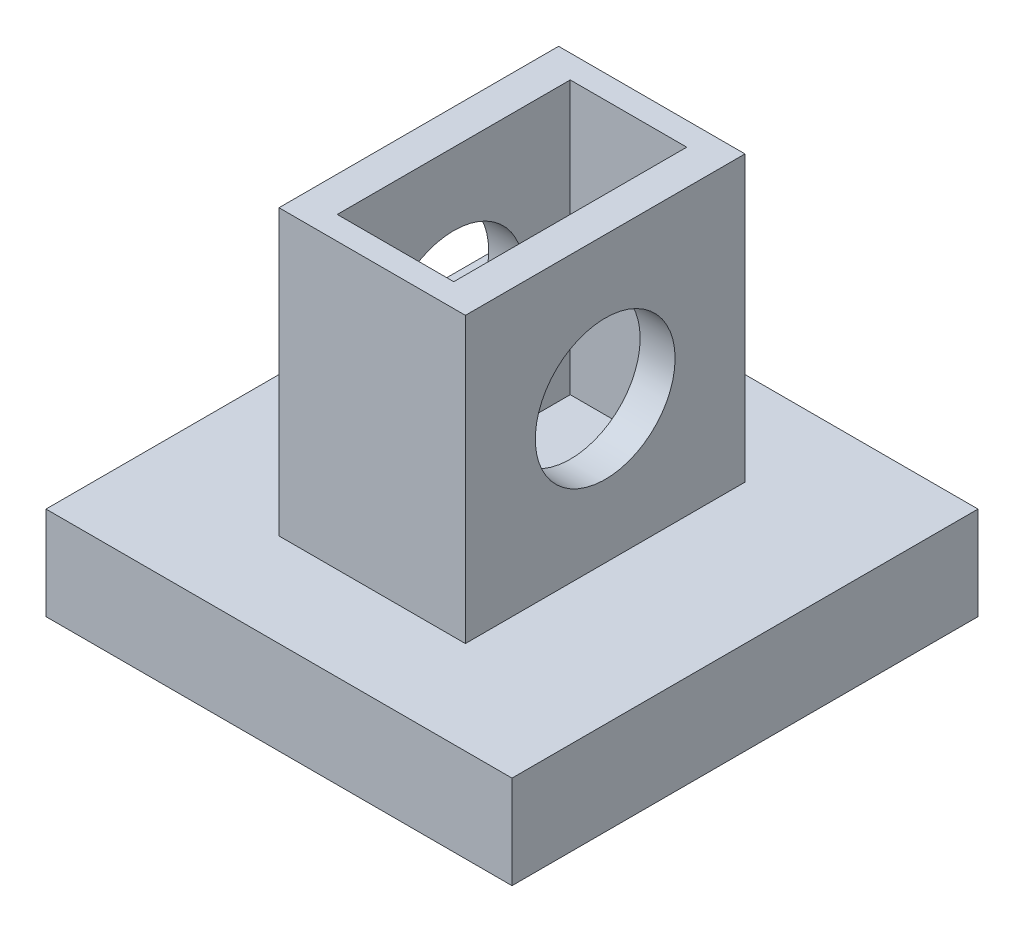
ISO-10303-21;
HEADER;
FILE_DESCRIPTION(('STEP AP214'),'2;1');
FILE_NAME('part.step','',(''),(''),'','','');
FILE_SCHEMA(('AUTOMOTIVE_DESIGN { 1 0 10303 214 1 1 1 1 }'));
ENDSEC;
DATA;
#1=APPLICATION_CONTEXT('core data for automotive mechanical design processes');
#2=APPLICATION_PROTOCOL_DEFINITION('international standard','automotive_design',2000,#1);
#3=PRODUCT_CONTEXT('',#1,'mechanical');
#4=PRODUCT('Part','Part','',(#3));
#5=PRODUCT_RELATED_PRODUCT_CATEGORY('part','',(#4));
#6=PRODUCT_DEFINITION_FORMATION('','',#4);
#7=PRODUCT_DEFINITION_CONTEXT('part definition',#1,'design');
#8=PRODUCT_DEFINITION('design','',#6,#7);
#9=PRODUCT_DEFINITION_SHAPE('','',#8);
#10=(LENGTH_UNIT() NAMED_UNIT(*) SI_UNIT(.MILLI.,.METRE.));
#11=(NAMED_UNIT(*) PLANE_ANGLE_UNIT() SI_UNIT($,.RADIAN.));
#12=(NAMED_UNIT(*) SI_UNIT($,.STERADIAN.) SOLID_ANGLE_UNIT());
#13=UNCERTAINTY_MEASURE_WITH_UNIT(LENGTH_MEASURE(1.E-05),#10,'distance_accuracy_value','');
#14=(GEOMETRIC_REPRESENTATION_CONTEXT(3) GLOBAL_UNCERTAINTY_ASSIGNED_CONTEXT((#13)) GLOBAL_UNIT_ASSIGNED_CONTEXT((#10,
#11,#12)) REPRESENTATION_CONTEXT('',''));
#15=CARTESIAN_POINT('',(0.,0.,0.));
#16=DIRECTION('',(0.,0.,1.));
#17=DIRECTION('',(1.,0.,0.));
#18=AXIS2_PLACEMENT_3D('',#15,#16,#17);
#19=CARTESIAN_POINT('',(-40.4037111239393,4.,20.3321901139824));
#20=DIRECTION('',(0.,0.,-1.));
#21=DIRECTION('',(-1.,0.,0.));
#22=AXIS2_PLACEMENT_3D('',#19,#20,#21);
#23=PLANE('',#22);
#24=DIRECTION('',(-1.,0.,0.));
#25=VECTOR('',#24,1.);
#26=CARTESIAN_POINT('',(-40.4037111239393,4.,20.3321901139824));
#27=LINE('',#26,#25);
#28=CARTESIAN_POINT('',(-15.4037111239393,4.,20.3321901139824));
#29=VERTEX_POINT('',#28);
#30=CARTESIAN_POINT('',(-23.4037111239393,4.,20.3321901139824));
#31=VERTEX_POINT('',#30);
#32=EDGE_CURVE('E11',#29,#31,#27,.T.);
#33=ORIENTED_EDGE('',*,*,#32,.F.);
#34=DIRECTION('',(0.,-1.,0.));
#35=VECTOR('',#34,1.);
#36=CARTESIAN_POINT('',(-15.4037111239393,16.2,20.3321901139824));
#37=LINE('',#36,#35);
#38=CARTESIAN_POINT('',(-15.4037111239393,16.2,20.3321901139824));
#39=VERTEX_POINT('',#38);
#40=EDGE_CURVE('E154',#39,#29,#37,.T.);
#41=ORIENTED_EDGE('',*,*,#40,.F.);
#42=DIRECTION('',(1.,0.,0.));
#43=VECTOR('',#42,1.);
#44=CARTESIAN_POINT('',(-23.4037111239393,16.2,20.3321901139824));
#45=LINE('',#44,#43);
#46=CARTESIAN_POINT('',(-23.4037111239393,16.2,20.3321901139824));
#47=VERTEX_POINT('',#46);
#48=EDGE_CURVE('E178',#47,#39,#45,.T.);
#49=ORIENTED_EDGE('',*,*,#48,.F.);
#50=DIRECTION('',(0.,-1.,0.));
#51=VECTOR('',#50,1.);
#52=CARTESIAN_POINT('',(-23.4037111239393,16.2,20.3321901139824));
#53=LINE('',#52,#51);
#54=EDGE_CURVE('E150',#47,#31,#53,.T.);
#55=ORIENTED_EDGE('',*,*,#54,.T.);
#56=EDGE_LOOP('',(#33,#41,#49,#55));
#57=FACE_BOUND('',#56,.T.);
#58=ADVANCED_FACE('F39',(#57),#23,.F.);
#59=CARTESIAN_POINT('',(-40.4037111239393,4.,4.33219011398236));
#60=DIRECTION('',(0.,0.,1.));
#61=DIRECTION('',(1.,0.,0.));
#62=AXIS2_PLACEMENT_3D('',#59,#60,#61);
#63=PLANE('',#62);
#64=DIRECTION('',(-1.,0.,0.));
#65=VECTOR('',#64,1.);
#66=CARTESIAN_POINT('',(-40.4037111239393,4.,4.33219011398236));
#67=LINE('',#66,#65);
#68=CARTESIAN_POINT('',(-9.40371112393931,4.,4.33219011398237));
#69=VERTEX_POINT('',#68);
#70=CARTESIAN_POINT('',(-29.4037111239393,4.,4.33219011398236));
#71=VERTEX_POINT('',#70);
#72=EDGE_CURVE('E47',#69,#71,#67,.T.);
#73=ORIENTED_EDGE('',*,*,#72,.F.);
#74=DIRECTION('',(0.,1.,0.));
#75=VECTOR('',#74,1.);
#76=CARTESIAN_POINT('',(-9.40371112393931,4.,4.33219011398237));
#77=LINE('',#76,#75);
#78=CARTESIAN_POINT('',(-9.40371112393931,0.,4.33219011398237));
#79=VERTEX_POINT('',#78);
#80=EDGE_CURVE('E128',#79,#69,#77,.T.);
#81=ORIENTED_EDGE('',*,*,#80,.F.);
#82=DIRECTION('',(-1.,0.,0.));
#83=VECTOR('',#82,1.);
#84=CARTESIAN_POINT('',(-40.4037111239393,0.,4.33219011398236));
#85=LINE('',#84,#83);
#86=CARTESIAN_POINT('',(-29.4037111239393,0.,4.33219011398236));
#87=VERTEX_POINT('',#86);
#88=EDGE_CURVE('E148',#79,#87,#85,.T.);
#89=ORIENTED_EDGE('',*,*,#88,.T.);
#90=DIRECTION('',(0.,-1.,0.));
#91=VECTOR('',#90,1.);
#92=CARTESIAN_POINT('',(-29.4037111239393,0.,4.33219011398236));
#93=LINE('',#92,#91);
#94=EDGE_CURVE('E147',#71,#87,#93,.T.);
#95=ORIENTED_EDGE('',*,*,#94,.F.);
#96=EDGE_LOOP('',(#73,#81,#89,#95));
#97=FACE_BOUND('',#96,.T.);
#98=ADVANCED_FACE('F146',(#97),#63,.F.);
#99=CARTESIAN_POINT('',(0.,4.,0.));
#100=DIRECTION('',(0.,1.,0.));
#101=DIRECTION('',(0.,0.,1.));
#102=AXIS2_PLACEMENT_3D('',#99,#100,#101);
#103=PLANE('',#102);
#104=DIRECTION('',(0.,0.,1.));
#105=VECTOR('',#104,1.);
#106=CARTESIAN_POINT('',(-9.40371112393931,4.,4.33219011398237));
#107=LINE('',#106,#105);
#108=CARTESIAN_POINT('',(-9.40371112393932,4.,24.3321901139824));
#109=VERTEX_POINT('',#108);
#110=EDGE_CURVE('E55',#69,#109,#107,.T.);
#111=ORIENTED_EDGE('',*,*,#110,.F.);
#112=ORIENTED_EDGE('',*,*,#72,.T.);
#113=DIRECTION('',(0.,0.,-1.));
#114=VECTOR('',#113,1.);
#115=CARTESIAN_POINT('',(-29.4037111239393,4.,4.33219011398236));
#116=LINE('',#115,#114);
#117=CARTESIAN_POINT('',(-29.4037111239393,4.,24.3321901139824));
#118=VERTEX_POINT('',#117);
#119=EDGE_CURVE('E226',#118,#71,#116,.T.);
#120=ORIENTED_EDGE('',*,*,#119,.F.);
#121=DIRECTION('',(-1.,0.,0.));
#122=VECTOR('',#121,1.);
#123=CARTESIAN_POINT('',(-40.4037111239393,4.,24.3321901139824));
#124=LINE('',#123,#122);
#125=EDGE_CURVE('E142',#109,#118,#124,.T.);
#126=ORIENTED_EDGE('',*,*,#125,.F.);
#127=EDGE_LOOP('',(#111,#112,#120,#126));
#128=FACE_BOUND('',#127,.T.);
#129=DIRECTION('',(0.,0.,1.));
#130=VECTOR('',#129,1.);
#131=CARTESIAN_POINT('',(-23.4037111239393,4.,20.3321901139824));
#132=LINE('',#131,#130);
#133=CARTESIAN_POINT('',(-23.4037111239393,4.,8.33219011398237));
#134=VERTEX_POINT('',#133);
#135=EDGE_CURVE('E171',#134,#31,#132,.T.);
#136=ORIENTED_EDGE('',*,*,#135,.F.);
#137=DIRECTION('',(-1.,0.,0.));
#138=VECTOR('',#137,1.);
#139=CARTESIAN_POINT('',(-23.4037111239393,4.,8.33219011398237));
#140=LINE('',#139,#138);
#141=CARTESIAN_POINT('',(-15.4037111239393,4.,8.33219011398237));
#142=VERTEX_POINT('',#141);
#143=EDGE_CURVE('E164',#142,#134,#140,.T.);
#144=ORIENTED_EDGE('',*,*,#143,.F.);
#145=DIRECTION('',(0.,0.,-1.));
#146=VECTOR('',#145,1.);
#147=CARTESIAN_POINT('',(-15.4037111239393,4.,20.3321901139824));
#148=LINE('',#147,#146);
#149=EDGE_CURVE('E168',#29,#142,#148,.T.);
#150=ORIENTED_EDGE('',*,*,#149,.F.);
#151=ORIENTED_EDGE('',*,*,#32,.T.);
#152=EDGE_LOOP('',(#136,#144,#150,#151));
#153=FACE_BOUND('',#152,.T.);
#154=ADVANCED_FACE('F138',(#128,#153),#103,.T.);
#155=CARTESIAN_POINT('',(0.,0.,0.));
#156=DIRECTION('',(0.,1.,0.));
#157=DIRECTION('',(0.,0.,1.));
#158=AXIS2_PLACEMENT_3D('',#155,#156,#157);
#159=PLANE('',#158);
#160=ORIENTED_EDGE('',*,*,#88,.F.);
#161=DIRECTION('',(0.,0.,-1.));
#162=VECTOR('',#161,1.);
#163=CARTESIAN_POINT('',(-9.40371112393931,0.,4.33219011398237));
#164=LINE('',#163,#162);
#165=CARTESIAN_POINT('',(-9.40371112393931,0.,24.3321901139824));
#166=VERTEX_POINT('',#165);
#167=EDGE_CURVE('E131',#166,#79,#164,.T.);
#168=ORIENTED_EDGE('',*,*,#167,.F.);
#169=DIRECTION('',(1.,0.,0.));
#170=VECTOR('',#169,1.);
#171=CARTESIAN_POINT('',(-40.4037111239393,0.,24.3321901139824));
#172=LINE('',#171,#170);
#173=CARTESIAN_POINT('',(-29.4037111239393,0.,24.3321901139824));
#174=VERTEX_POINT('',#173);
#175=EDGE_CURVE('E223',#174,#166,#172,.T.);
#176=ORIENTED_EDGE('',*,*,#175,.F.);
#177=DIRECTION('',(0.,0.,1.));
#178=VECTOR('',#177,1.);
#179=CARTESIAN_POINT('',(-29.4037111239393,0.,4.33219011398236));
#180=LINE('',#179,#178);
#181=EDGE_CURVE('E63',#87,#174,#180,.T.);
#182=ORIENTED_EDGE('',*,*,#181,.F.);
#183=EDGE_LOOP('',(#160,#168,#176,#182));
#184=FACE_BOUND('',#183,.T.);
#185=ADVANCED_FACE('F236',(#184),#159,.F.);
#186=CARTESIAN_POINT('',(-23.4037111239393,16.2,20.3321901139824));
#187=DIRECTION('',(1.,0.,0.));
#188=DIRECTION('',(0.,0.,-1.));
#189=AXIS2_PLACEMENT_3D('',#186,#187,#188);
#190=PLANE('',#189);
#191=CARTESIAN_POINT('',(-23.4037111239393,10.1,14.3321901139824));
#192=DIRECTION('',(1.,0.,0.));
#193=DIRECTION('',(0.,0.,-1.));
#194=AXIS2_PLACEMENT_3D('',#191,#192,#193);
#195=CIRCLE('',#194,3.);
#196=CARTESIAN_POINT('',(-23.4037111239393,10.1,11.3321901139824));
#197=VERTEX_POINT('',#196);
#198=EDGE_CURVE('E219',#197,#197,#195,.T.);
#199=ORIENTED_EDGE('',*,*,#198,.T.);
#200=EDGE_LOOP('',(#199));
#201=FACE_BOUND('',#200,.T.);
#202=ORIENTED_EDGE('',*,*,#135,.T.);
#203=ORIENTED_EDGE('',*,*,#54,.F.);
#204=DIRECTION('',(0.,0.,1.));
#205=VECTOR('',#204,1.);
#206=CARTESIAN_POINT('',(-23.4037111239393,16.2,20.3321901139824));
#207=LINE('',#206,#205);
#208=CARTESIAN_POINT('',(-23.4037111239393,16.2,8.33219011398237));
#209=VERTEX_POINT('',#208);
#210=EDGE_CURVE('E167',#209,#47,#207,.T.);
#211=ORIENTED_EDGE('',*,*,#210,.F.);
#212=DIRECTION('',(0.,-1.,0.));
#213=VECTOR('',#212,1.);
#214=CARTESIAN_POINT('',(-23.4037111239393,16.2,8.33219011398237));
#215=LINE('',#214,#213);
#216=EDGE_CURVE('E160',#209,#134,#215,.T.);
#217=ORIENTED_EDGE('',*,*,#216,.T.);
#218=EDGE_LOOP('',(#202,#203,#211,#217));
#219=FACE_BOUND('',#218,.T.);
#220=ADVANCED_FACE('F266',(#201,#219),#190,.F.);
#221=CARTESIAN_POINT('',(-15.4037111239393,16.2,20.3321901139824));
#222=DIRECTION('',(-1.,0.,0.));
#223=DIRECTION('',(0.,0.,1.));
#224=AXIS2_PLACEMENT_3D('',#221,#222,#223);
#225=PLANE('',#224);
#226=CARTESIAN_POINT('',(-15.4037111239393,10.1,14.3321901139824));
#227=DIRECTION('',(1.,0.,0.));
#228=DIRECTION('',(0.,0.,-1.));
#229=AXIS2_PLACEMENT_3D('',#226,#227,#228);
#230=CIRCLE('',#229,3.);
#231=CARTESIAN_POINT('',(-15.4037111239393,10.1,11.3321901139824));
#232=VERTEX_POINT('',#231);
#233=EDGE_CURVE('E216',#232,#232,#230,.T.);
#234=ORIENTED_EDGE('',*,*,#233,.F.);
#235=EDGE_LOOP('',(#234));
#236=FACE_BOUND('',#235,.T.);
#237=ORIENTED_EDGE('',*,*,#149,.T.);
#238=DIRECTION('',(0.,-1.,0.));
#239=VECTOR('',#238,1.);
#240=CARTESIAN_POINT('',(-15.4037111239393,16.2,8.33219011398237));
#241=LINE('',#240,#239);
#242=CARTESIAN_POINT('',(-15.4037111239393,16.2,8.33219011398237));
#243=VERTEX_POINT('',#242);
#244=EDGE_CURVE('E157',#243,#142,#241,.T.);
#245=ORIENTED_EDGE('',*,*,#244,.F.);
#246=DIRECTION('',(0.,0.,-1.));
#247=VECTOR('',#246,1.);
#248=CARTESIAN_POINT('',(-15.4037111239393,16.2,20.3321901139824));
#249=LINE('',#248,#247);
#250=EDGE_CURVE('E176',#39,#243,#249,.T.);
#251=ORIENTED_EDGE('',*,*,#250,.F.);
#252=ORIENTED_EDGE('',*,*,#40,.T.);
#253=EDGE_LOOP('',(#237,#245,#251,#252));
#254=FACE_BOUND('',#253,.T.);
#255=ADVANCED_FACE('F259',(#236,#254),#225,.F.);
#256=CARTESIAN_POINT('',(-23.4037111239393,16.2,8.33219011398237));
#257=DIRECTION('',(0.,0.,1.));
#258=DIRECTION('',(1.,0.,0.));
#259=AXIS2_PLACEMENT_3D('',#256,#257,#258);
#260=PLANE('',#259);
#261=ORIENTED_EDGE('',*,*,#143,.T.);
#262=ORIENTED_EDGE('',*,*,#216,.F.);
#263=DIRECTION('',(-1.,0.,0.));
#264=VECTOR('',#263,1.);
#265=CARTESIAN_POINT('',(-23.4037111239393,16.2,8.33219011398237));
#266=LINE('',#265,#264);
#267=EDGE_CURVE('E163',#243,#209,#266,.T.);
#268=ORIENTED_EDGE('',*,*,#267,.F.);
#269=ORIENTED_EDGE('',*,*,#244,.T.);
#270=EDGE_LOOP('',(#261,#262,#268,#269));
#271=FACE_BOUND('',#270,.T.);
#272=ADVANCED_FACE('F268',(#271),#260,.F.);
#273=CARTESIAN_POINT('',(0.,16.2,0.));
#274=DIRECTION('',(0.,-1.,0.));
#275=DIRECTION('',(0.,0.,-1.));
#276=AXIS2_PLACEMENT_3D('',#273,#274,#275);
#277=PLANE('',#276);
#278=DIRECTION('',(1.,0.,0.));
#279=VECTOR('',#278,1.);
#280=CARTESIAN_POINT('',(-21.9037111239393,16.2,19.3321901139824));
#281=LINE('',#280,#279);
#282=CARTESIAN_POINT('',(-21.9037111239393,16.2,19.3321901139824));
#283=VERTEX_POINT('',#282);
#284=CARTESIAN_POINT('',(-16.9037111239393,16.2,19.3321901139824));
#285=VERTEX_POINT('',#284);
#286=EDGE_CURVE('E198',#283,#285,#281,.T.);
#287=ORIENTED_EDGE('',*,*,#286,.F.);
#288=DIRECTION('',(0.,0.,1.));
#289=VECTOR('',#288,1.);
#290=CARTESIAN_POINT('',(-21.9037111239393,16.2,9.33219011398237));
#291=LINE('',#290,#289);
#292=CARTESIAN_POINT('',(-21.9037111239393,16.2,9.33219011398237));
#293=VERTEX_POINT('',#292);
#294=EDGE_CURVE('E201',#293,#283,#291,.T.);
#295=ORIENTED_EDGE('',*,*,#294,.F.);
#296=DIRECTION('',(-1.,0.,0.));
#297=VECTOR('',#296,1.);
#298=CARTESIAN_POINT('',(-21.9037111239393,16.2,9.33219011398237));
#299=LINE('',#298,#297);
#300=CARTESIAN_POINT('',(-16.9037111239393,16.2,9.33219011398237));
#301=VERTEX_POINT('',#300);
#302=EDGE_CURVE('E191',#301,#293,#299,.T.);
#303=ORIENTED_EDGE('',*,*,#302,.F.);
#304=DIRECTION('',(0.,0.,-1.));
#305=VECTOR('',#304,1.);
#306=CARTESIAN_POINT('',(-16.9037111239393,16.2,9.33219011398237));
#307=LINE('',#306,#305);
#308=EDGE_CURVE('E195',#285,#301,#307,.T.);
#309=ORIENTED_EDGE('',*,*,#308,.F.);
#310=EDGE_LOOP('',(#287,#295,#303,#309));
#311=FACE_BOUND('',#310,.T.);
#312=ORIENTED_EDGE('',*,*,#210,.T.);
#313=ORIENTED_EDGE('',*,*,#48,.T.);
#314=ORIENTED_EDGE('',*,*,#250,.T.);
#315=ORIENTED_EDGE('',*,*,#267,.T.);
#316=EDGE_LOOP('',(#312,#313,#314,#315));
#317=FACE_BOUND('',#316,.T.);
#318=ADVANCED_FACE('F262',(#311,#317),#277,.F.);
#319=CARTESIAN_POINT('',(-21.9037111239393,4.5,9.33219011398237));
#320=DIRECTION('',(-1.,0.,0.));
#321=DIRECTION('',(0.,0.,1.));
#322=AXIS2_PLACEMENT_3D('',#319,#320,#321);
#323=PLANE('',#322);
#324=CARTESIAN_POINT('',(-21.9037111239393,10.1,14.3321901139824));
#325=DIRECTION('',(-1.,0.,0.));
#326=DIRECTION('',(0.,0.,1.));
#327=AXIS2_PLACEMENT_3D('',#324,#325,#326);
#328=CIRCLE('',#327,3.);
#329=CARTESIAN_POINT('',(-21.9037111239393,10.1,17.3321901139824));
#330=VERTEX_POINT('',#329);
#331=EDGE_CURVE('E203',#330,#330,#328,.T.);
#332=ORIENTED_EDGE('',*,*,#331,.T.);
#333=EDGE_LOOP('',(#332));
#334=FACE_BOUND('',#333,.T.);
#335=ORIENTED_EDGE('',*,*,#294,.T.);
#336=DIRECTION('',(0.,1.,0.));
#337=VECTOR('',#336,1.);
#338=CARTESIAN_POINT('',(-21.9037111239393,4.5,19.3321901139824));
#339=LINE('',#338,#337);
#340=CARTESIAN_POINT('',(-21.9037111239393,4.5,19.3321901139824));
#341=VERTEX_POINT('',#340);
#342=EDGE_CURVE('E182',#341,#283,#339,.T.);
#343=ORIENTED_EDGE('',*,*,#342,.F.);
#344=DIRECTION('',(0.,0.,1.));
#345=VECTOR('',#344,1.);
#346=CARTESIAN_POINT('',(-21.9037111239393,4.5,9.33219011398237));
#347=LINE('',#346,#345);
#348=CARTESIAN_POINT('',(-21.9037111239393,4.5,9.33219011398237));
#349=VERTEX_POINT('',#348);
#350=EDGE_CURVE('E194',#349,#341,#347,.T.);
#351=ORIENTED_EDGE('',*,*,#350,.F.);
#352=DIRECTION('',(0.,1.,0.));
#353=VECTOR('',#352,1.);
#354=CARTESIAN_POINT('',(-21.9037111239393,4.5,9.33219011398237));
#355=LINE('',#354,#353);
#356=EDGE_CURVE('E174',#349,#293,#355,.T.);
#357=ORIENTED_EDGE('',*,*,#356,.T.);
#358=EDGE_LOOP('',(#335,#343,#351,#357));
#359=FACE_BOUND('',#358,.T.);
#360=ADVANCED_FACE('F275',(#334,#359),#323,.F.);
#361=CARTESIAN_POINT('',(-21.9037111239393,4.5,9.33219011398237));
#362=DIRECTION('',(0.,0.,-1.));
#363=DIRECTION('',(-1.,0.,0.));
#364=AXIS2_PLACEMENT_3D('',#361,#362,#363);
#365=PLANE('',#364);
#366=ORIENTED_EDGE('',*,*,#302,.T.);
#367=ORIENTED_EDGE('',*,*,#356,.F.);
#368=DIRECTION('',(-1.,0.,0.));
#369=VECTOR('',#368,1.);
#370=CARTESIAN_POINT('',(-21.9037111239393,4.5,9.33219011398237));
#371=LINE('',#370,#369);
#372=CARTESIAN_POINT('',(-16.9037111239393,4.5,9.33219011398237));
#373=VERTEX_POINT('',#372);
#374=EDGE_CURVE('E186',#373,#349,#371,.T.);
#375=ORIENTED_EDGE('',*,*,#374,.F.);
#376=DIRECTION('',(0.,1.,0.));
#377=VECTOR('',#376,1.);
#378=CARTESIAN_POINT('',(-16.9037111239393,4.5,9.33219011398237));
#379=LINE('',#378,#377);
#380=EDGE_CURVE('E188',#373,#301,#379,.T.);
#381=ORIENTED_EDGE('',*,*,#380,.T.);
#382=EDGE_LOOP('',(#366,#367,#375,#381));
#383=FACE_BOUND('',#382,.T.);
#384=ADVANCED_FACE('F380',(#383),#365,.F.);
#385=CARTESIAN_POINT('',(-16.9037111239393,4.5,9.33219011398237));
#386=DIRECTION('',(1.,0.,0.));
#387=DIRECTION('',(0.,0.,-1.));
#388=AXIS2_PLACEMENT_3D('',#385,#386,#387);
#389=PLANE('',#388);
#390=CARTESIAN_POINT('',(-16.9037111239393,10.1,14.3321901139824));
#391=DIRECTION('',(1.,0.,0.));
#392=DIRECTION('',(0.,0.,-1.));
#393=AXIS2_PLACEMENT_3D('',#390,#391,#392);
#394=CIRCLE('',#393,3.);
#395=CARTESIAN_POINT('',(-16.9037111239393,10.1,11.3321901139824));
#396=VERTEX_POINT('',#395);
#397=EDGE_CURVE('E42',#396,#396,#394,.T.);
#398=ORIENTED_EDGE('',*,*,#397,.T.);
#399=EDGE_LOOP('',(#398));
#400=FACE_BOUND('',#399,.T.);
#401=ORIENTED_EDGE('',*,*,#308,.T.);
#402=ORIENTED_EDGE('',*,*,#380,.F.);
#403=DIRECTION('',(0.,0.,-1.));
#404=VECTOR('',#403,1.);
#405=CARTESIAN_POINT('',(-16.9037111239393,4.5,9.33219011398237));
#406=LINE('',#405,#404);
#407=CARTESIAN_POINT('',(-16.9037111239393,4.5,19.3321901139824));
#408=VERTEX_POINT('',#407);
#409=EDGE_CURVE('E206',#408,#373,#406,.T.);
#410=ORIENTED_EDGE('',*,*,#409,.F.);
#411=DIRECTION('',(0.,1.,0.));
#412=VECTOR('',#411,1.);
#413=CARTESIAN_POINT('',(-16.9037111239393,4.5,19.3321901139824));
#414=LINE('',#413,#412);
#415=EDGE_CURVE('E185',#408,#285,#414,.T.);
#416=ORIENTED_EDGE('',*,*,#415,.T.);
#417=EDGE_LOOP('',(#401,#402,#410,#416));
#418=FACE_BOUND('',#417,.T.);
#419=ADVANCED_FACE('F372',(#400,#418),#389,.F.);
#420=CARTESIAN_POINT('',(-21.9037111239393,4.5,19.3321901139824));
#421=DIRECTION('',(0.,0.,1.));
#422=DIRECTION('',(1.,0.,0.));
#423=AXIS2_PLACEMENT_3D('',#420,#421,#422);
#424=PLANE('',#423);
#425=ORIENTED_EDGE('',*,*,#286,.T.);
#426=ORIENTED_EDGE('',*,*,#415,.F.);
#427=DIRECTION('',(1.,0.,0.));
#428=VECTOR('',#427,1.);
#429=CARTESIAN_POINT('',(-21.9037111239393,4.5,19.3321901139824));
#430=LINE('',#429,#428);
#431=EDGE_CURVE('E209',#341,#408,#430,.T.);
#432=ORIENTED_EDGE('',*,*,#431,.F.);
#433=ORIENTED_EDGE('',*,*,#342,.T.);
#434=EDGE_LOOP('',(#425,#426,#432,#433));
#435=FACE_BOUND('',#434,.T.);
#436=ADVANCED_FACE('F363',(#435),#424,.F.);
#437=CARTESIAN_POINT('',(0.,4.5,0.));
#438=DIRECTION('',(0.,1.,0.));
#439=DIRECTION('',(0.,0.,1.));
#440=AXIS2_PLACEMENT_3D('',#437,#438,#439);
#441=PLANE('',#440);
#442=ORIENTED_EDGE('',*,*,#350,.T.);
#443=ORIENTED_EDGE('',*,*,#431,.T.);
#444=ORIENTED_EDGE('',*,*,#409,.T.);
#445=ORIENTED_EDGE('',*,*,#374,.T.);
#446=EDGE_LOOP('',(#442,#443,#444,#445));
#447=FACE_BOUND('',#446,.T.);
#448=ADVANCED_FACE('F355',(#447),#441,.T.);
#449=CARTESIAN_POINT('',(-23.4037111239393,10.1,14.3321901139824));
#450=DIRECTION('',(1.,0.,0.));
#451=DIRECTION('',(0.,0.,-1.));
#452=AXIS2_PLACEMENT_3D('',#449,#450,#451);
#453=CYLINDRICAL_SURFACE('',#452,3.);
#454=ORIENTED_EDGE('',*,*,#233,.T.);
#455=EDGE_LOOP('',(#454));
#456=FACE_BOUND('',#455,.T.);
#457=ORIENTED_EDGE('',*,*,#397,.F.);
#458=EDGE_LOOP('',(#457));
#459=FACE_BOUND('',#458,.T.);
#460=ADVANCED_FACE('F347',(#456,#459),#453,.F.);
#461=ORIENTED_EDGE('',*,*,#198,.F.);
#462=EDGE_LOOP('',(#461));
#463=FACE_BOUND('',#462,.T.);
#464=ORIENTED_EDGE('',*,*,#331,.F.);
#465=EDGE_LOOP('',(#464));
#466=FACE_BOUND('',#465,.T.);
#467=ADVANCED_FACE('F246',(#463,#466),#453,.F.);
#468=CARTESIAN_POINT('',(0.,0.,24.3321901139824));
#469=DIRECTION('',(0.,0.,-1.));
#470=DIRECTION('',(-1.,0.,0.));
#471=AXIS2_PLACEMENT_3D('',#468,#469,#470);
#472=PLANE('',#471);
#473=ORIENTED_EDGE('',*,*,#175,.T.);
#474=DIRECTION('',(0.,-1.,0.));
#475=VECTOR('',#474,1.);
#476=CARTESIAN_POINT('',(-9.40371112393931,4.,24.3321901139824));
#477=LINE('',#476,#475);
#478=EDGE_CURVE('E143',#109,#166,#477,.T.);
#479=ORIENTED_EDGE('',*,*,#478,.F.);
#480=ORIENTED_EDGE('',*,*,#125,.T.);
#481=DIRECTION('',(0.,1.,0.));
#482=VECTOR('',#481,1.);
#483=CARTESIAN_POINT('',(-29.4037111239393,0.,24.3321901139824));
#484=LINE('',#483,#482);
#485=EDGE_CURVE('E228',#174,#118,#484,.T.);
#486=ORIENTED_EDGE('',*,*,#485,.F.);
#487=EDGE_LOOP('',(#473,#479,#480,#486));
#488=FACE_BOUND('',#487,.T.);
#489=ADVANCED_FACE('F237',(#488),#472,.F.);
#490=CARTESIAN_POINT('',(-29.4037111239393,0.,0.));
#491=DIRECTION('',(1.,0.,0.));
#492=DIRECTION('',(0.,0.,-1.));
#493=AXIS2_PLACEMENT_3D('',#490,#491,#492);
#494=PLANE('',#493);
#495=ORIENTED_EDGE('',*,*,#94,.T.);
#496=ORIENTED_EDGE('',*,*,#181,.T.);
#497=ORIENTED_EDGE('',*,*,#485,.T.);
#498=ORIENTED_EDGE('',*,*,#119,.T.);
#499=EDGE_LOOP('',(#495,#496,#497,#498));
#500=FACE_BOUND('',#499,.T.);
#501=ADVANCED_FACE('F238',(#500),#494,.F.);
#502=CARTESIAN_POINT('',(-9.40371112393931,0.,0.));
#503=DIRECTION('',(-1.,0.,0.));
#504=DIRECTION('',(0.,0.,1.));
#505=AXIS2_PLACEMENT_3D('',#502,#503,#504);
#506=PLANE('',#505);
#507=ORIENTED_EDGE('',*,*,#80,.T.);
#508=ORIENTED_EDGE('',*,*,#110,.T.);
#509=ORIENTED_EDGE('',*,*,#478,.T.);
#510=ORIENTED_EDGE('',*,*,#167,.T.);
#511=EDGE_LOOP('',(#507,#508,#509,#510));
#512=FACE_BOUND('',#511,.T.);
#513=ADVANCED_FACE('F129',(#512),#506,.F.);
#514=CLOSED_SHELL('',(#58,#98,#154,#185,#220,#255,#272,#318,#360,#384,#419,#436,#448,#460,#467,
#489,#501,#513));
#515=MANIFOLD_SOLID_BREP('B2',#514);
#516=ADVANCED_BREP_SHAPE_REPRESENTATION('',(#18,#515),#14);
#517=SHAPE_DEFINITION_REPRESENTATION(#9,#516);
ENDSEC;
END-ISO-10303-21;
